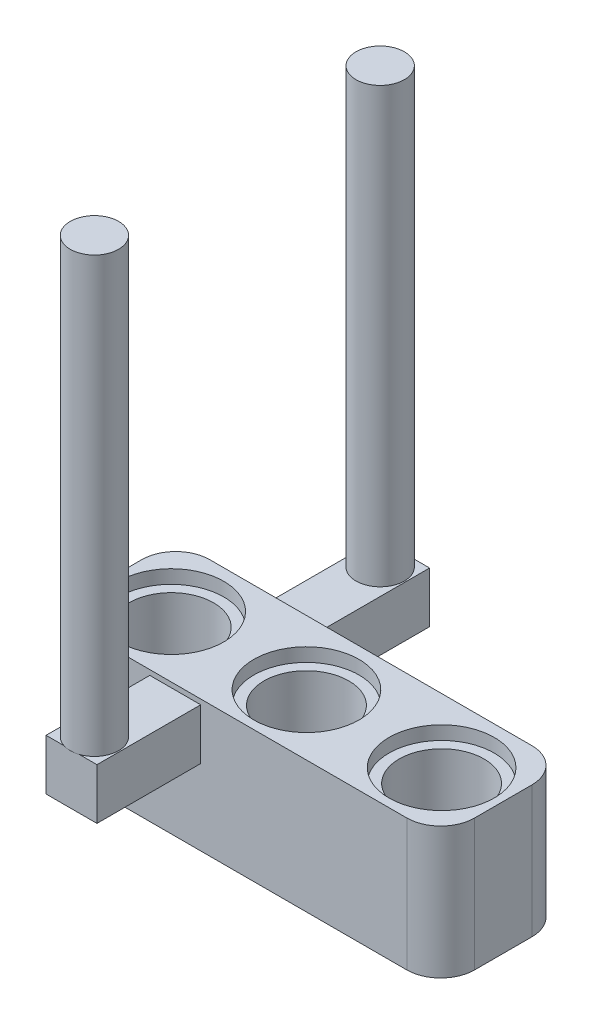
ISO-10303-21;
HEADER;
FILE_DESCRIPTION(('STEP AP214'),'2;1');
FILE_NAME('part.step','',(''),(''),'','','');
FILE_SCHEMA(('AUTOMOTIVE_DESIGN { 1 0 10303 214 1 1 1 1 }'));
ENDSEC;
DATA;
#1=APPLICATION_CONTEXT('core data for automotive mechanical design processes');
#2=APPLICATION_PROTOCOL_DEFINITION('international standard','automotive_design',2000,#1);
#3=PRODUCT_CONTEXT('',#1,'mechanical');
#4=PRODUCT('Part','Part','',(#3));
#5=PRODUCT_RELATED_PRODUCT_CATEGORY('part','',(#4));
#6=PRODUCT_DEFINITION_FORMATION('','',#4);
#7=PRODUCT_DEFINITION_CONTEXT('part definition',#1,'design');
#8=PRODUCT_DEFINITION('design','',#6,#7);
#9=PRODUCT_DEFINITION_SHAPE('','',#8);
#10=(LENGTH_UNIT() NAMED_UNIT(*) SI_UNIT(.MILLI.,.METRE.));
#11=(NAMED_UNIT(*) PLANE_ANGLE_UNIT() SI_UNIT($,.RADIAN.));
#12=(NAMED_UNIT(*) SI_UNIT($,.STERADIAN.) SOLID_ANGLE_UNIT());
#13=UNCERTAINTY_MEASURE_WITH_UNIT(LENGTH_MEASURE(1.E-05),#10,'distance_accuracy_value','');
#14=(GEOMETRIC_REPRESENTATION_CONTEXT(3) GLOBAL_UNCERTAINTY_ASSIGNED_CONTEXT((#13)) GLOBAL_UNIT_ASSIGNED_CONTEXT((#10,
#11,#12)) REPRESENTATION_CONTEXT('',''));
#15=CARTESIAN_POINT('',(0.,0.,0.));
#16=DIRECTION('',(0.,0.,1.));
#17=DIRECTION('',(1.,0.,0.));
#18=AXIS2_PLACEMENT_3D('',#15,#16,#17);
#19=CARTESIAN_POINT('',(0.,7.76,0.));
#20=DIRECTION('',(0.,0.,-1.));
#21=DIRECTION('',(-1.,0.,0.));
#22=AXIS2_PLACEMENT_3D('',#19,#20,#21);
#23=PLANE('',#22);
#24=DIRECTION('',(1.,0.,0.));
#25=VECTOR('',#24,1.);
#26=CARTESIAN_POINT('',(0.,7.76,0.));
#27=LINE('',#26,#25);
#28=CARTESIAN_POINT('',(-21.,7.76,0.));
#29=VERTEX_POINT('',#28);
#30=CARTESIAN_POINT('',(-2.,7.76,0.));
#31=VERTEX_POINT('',#30);
#32=EDGE_CURVE('E310',#29,#31,#27,.T.);
#33=ORIENTED_EDGE('',*,*,#32,.F.);
#34=DIRECTION('',(0.,1.,0.));
#35=VECTOR('',#34,1.);
#36=CARTESIAN_POINT('',(-21.,7.76,0.));
#37=LINE('',#36,#35);
#38=CARTESIAN_POINT('',(-21.,0.,0.));
#39=VERTEX_POINT('',#38);
#40=EDGE_CURVE('E340',#29,#39,#37,.F.);
#41=ORIENTED_EDGE('',*,*,#40,.T.);
#42=DIRECTION('',(1.,0.,0.));
#43=VECTOR('',#42,1.);
#44=CARTESIAN_POINT('',(0.,0.,0.));
#45=LINE('',#44,#43);
#46=CARTESIAN_POINT('',(-2.,0.,0.));
#47=VERTEX_POINT('',#46);
#48=EDGE_CURVE('E306',#39,#47,#45,.T.);
#49=ORIENTED_EDGE('',*,*,#48,.T.);
#50=DIRECTION('',(0.,-1.,0.));
#51=VECTOR('',#50,1.);
#52=CARTESIAN_POINT('',(-2.,7.76,0.));
#53=LINE('',#52,#51);
#54=EDGE_CURVE('E329',#47,#31,#53,.F.);
#55=ORIENTED_EDGE('',*,*,#54,.T.);
#56=EDGE_LOOP('',(#33,#41,#49,#55));
#57=FACE_BOUND('',#56,.T.);
#58=DIRECTION('',(0.,-1.,0.));
#59=VECTOR('',#58,1.);
#60=CARTESIAN_POINT('',(-17.15,7.46280802617594,0.));
#61=LINE('',#60,#59);
#62=CARTESIAN_POINT('',(-17.15,7.46280802617594,0.));
#63=VERTEX_POINT('',#62);
#64=CARTESIAN_POINT('',(-17.15,4.46280802617594,0.));
#65=VERTEX_POINT('',#64);
#66=EDGE_CURVE('E192',#63,#65,#61,.T.);
#67=ORIENTED_EDGE('',*,*,#66,.F.);
#68=DIRECTION('',(-1.,0.,0.));
#69=VECTOR('',#68,1.);
#70=CARTESIAN_POINT('',(-17.15,7.46280802617594,0.));
#71=LINE('',#70,#69);
#72=CARTESIAN_POINT('',(-14.15,7.46280802617594,0.));
#73=VERTEX_POINT('',#72);
#74=EDGE_CURVE('E189',#73,#63,#71,.T.);
#75=ORIENTED_EDGE('',*,*,#74,.F.);
#76=DIRECTION('',(0.,1.,0.));
#77=VECTOR('',#76,1.);
#78=CARTESIAN_POINT('',(-14.15,7.46280802617594,0.));
#79=LINE('',#78,#77);
#80=CARTESIAN_POINT('',(-14.15,4.46280802617594,0.));
#81=VERTEX_POINT('',#80);
#82=EDGE_CURVE('E198',#81,#73,#79,.T.);
#83=ORIENTED_EDGE('',*,*,#82,.F.);
#84=DIRECTION('',(1.,0.,0.));
#85=VECTOR('',#84,1.);
#86=CARTESIAN_POINT('',(-17.15,4.46280802617594,0.));
#87=LINE('',#86,#85);
#88=EDGE_CURVE('E55',#65,#81,#87,.T.);
#89=ORIENTED_EDGE('',*,*,#88,.F.);
#90=EDGE_LOOP('',(#67,#75,#83,#89));
#91=FACE_BOUND('',#90,.T.);
#92=ADVANCED_FACE('F33',(#57,#91),#23,.F.);
#93=CARTESIAN_POINT('',(0.,7.76,-7.38));
#94=DIRECTION('',(0.,0.,1.));
#95=DIRECTION('',(1.,0.,0.));
#96=AXIS2_PLACEMENT_3D('',#93,#94,#95);
#97=PLANE('',#96);
#98=DIRECTION('',(-1.,0.,0.));
#99=VECTOR('',#98,1.);
#100=CARTESIAN_POINT('',(0.,7.76,-7.38));
#101=LINE('',#100,#99);
#102=CARTESIAN_POINT('',(-2.,7.76,-7.38));
#103=VERTEX_POINT('',#102);
#104=CARTESIAN_POINT('',(-21.,7.76,-7.38));
#105=VERTEX_POINT('',#104);
#106=EDGE_CURVE('E305',#103,#105,#101,.T.);
#107=ORIENTED_EDGE('',*,*,#106,.F.);
#108=DIRECTION('',(0.,-1.,0.));
#109=VECTOR('',#108,1.);
#110=CARTESIAN_POINT('',(-2.,7.76,-7.38));
#111=LINE('',#110,#109);
#112=CARTESIAN_POINT('',(-2.,0.,-7.38));
#113=VERTEX_POINT('',#112);
#114=EDGE_CURVE('E359',#103,#113,#111,.T.);
#115=ORIENTED_EDGE('',*,*,#114,.T.);
#116=DIRECTION('',(-1.,0.,0.));
#117=VECTOR('',#116,1.);
#118=CARTESIAN_POINT('',(0.,0.,-7.38));
#119=LINE('',#118,#117);
#120=CARTESIAN_POINT('',(-21.,0.,-7.38));
#121=VERTEX_POINT('',#120);
#122=EDGE_CURVE('E315',#113,#121,#119,.T.);
#123=ORIENTED_EDGE('',*,*,#122,.T.);
#124=DIRECTION('',(0.,1.,0.));
#125=VECTOR('',#124,1.);
#126=CARTESIAN_POINT('',(-21.,7.76,-7.38));
#127=LINE('',#126,#125);
#128=EDGE_CURVE('E348',#121,#105,#127,.T.);
#129=ORIENTED_EDGE('',*,*,#128,.T.);
#130=EDGE_LOOP('',(#107,#115,#123,#129));
#131=FACE_BOUND('',#130,.T.);
#132=DIRECTION('',(0.,-1.,0.));
#133=VECTOR('',#132,1.);
#134=CARTESIAN_POINT('',(-14.15,4.70025145904174,-7.38));
#135=LINE('',#134,#133);
#136=CARTESIAN_POINT('',(-14.15,7.70025145904174,-7.38));
#137=VERTEX_POINT('',#136);
#138=CARTESIAN_POINT('',(-14.15,4.70025145904174,-7.38));
#139=VERTEX_POINT('',#138);
#140=EDGE_CURVE('E215',#137,#139,#135,.T.);
#141=ORIENTED_EDGE('',*,*,#140,.F.);
#142=DIRECTION('',(1.,0.,0.));
#143=VECTOR('',#142,1.);
#144=CARTESIAN_POINT('',(-14.15,7.70025145904174,-7.38));
#145=LINE('',#144,#143);
#146=CARTESIAN_POINT('',(-17.15,7.70025145904174,-7.38));
#147=VERTEX_POINT('',#146);
#148=EDGE_CURVE('E223',#147,#137,#145,.T.);
#149=ORIENTED_EDGE('',*,*,#148,.F.);
#150=DIRECTION('',(0.,1.,0.));
#151=VECTOR('',#150,1.);
#152=CARTESIAN_POINT('',(-17.15,4.70025145904174,-7.38));
#153=LINE('',#152,#151);
#154=CARTESIAN_POINT('',(-17.15,4.70025145904174,-7.38));
#155=VERTEX_POINT('',#154);
#156=EDGE_CURVE('E238',#155,#147,#153,.T.);
#157=ORIENTED_EDGE('',*,*,#156,.F.);
#158=DIRECTION('',(-1.,0.,0.));
#159=VECTOR('',#158,1.);
#160=CARTESIAN_POINT('',(-14.15,4.70025145904174,-7.38));
#161=LINE('',#160,#159);
#162=EDGE_CURVE('E235',#139,#155,#161,.T.);
#163=ORIENTED_EDGE('',*,*,#162,.F.);
#164=EDGE_LOOP('',(#141,#149,#157,#163));
#165=FACE_BOUND('',#164,.T.);
#166=ADVANCED_FACE('F374',(#131,#165),#97,.F.);
#167=CARTESIAN_POINT('',(-2.,7.76,-5.38));
#168=DIRECTION('',(0.,-1.,0.));
#169=DIRECTION('',(0.,0.,-1.));
#170=AXIS2_PLACEMENT_3D('',#167,#168,#169);
#171=CYLINDRICAL_SURFACE('',#170,2.);
#172=ORIENTED_EDGE('',*,*,#114,.F.);
#173=CARTESIAN_POINT('',(-2.,7.76,-5.38));
#174=DIRECTION('',(0.,1.,0.));
#175=DIRECTION('',(0.,0.,1.));
#176=AXIS2_PLACEMENT_3D('',#173,#174,#175);
#177=CIRCLE('',#176,2.);
#178=CARTESIAN_POINT('',(0.,7.76,-5.38));
#179=VERTEX_POINT('',#178);
#180=EDGE_CURVE('E41',#179,#103,#177,.T.);
#181=ORIENTED_EDGE('',*,*,#180,.F.);
#182=DIRECTION('',(0.,-1.,0.));
#183=VECTOR('',#182,1.);
#184=CARTESIAN_POINT('',(0.,7.76,-5.38));
#185=LINE('',#184,#183);
#186=CARTESIAN_POINT('',(0.,0.,-5.38));
#187=VERTEX_POINT('',#186);
#188=EDGE_CURVE('E362',#187,#179,#185,.F.);
#189=ORIENTED_EDGE('',*,*,#188,.F.);
#190=CARTESIAN_POINT('',(-2.,0.,-5.38));
#191=DIRECTION('',(0.,1.,0.));
#192=DIRECTION('',(0.,0.,1.));
#193=AXIS2_PLACEMENT_3D('',#190,#191,#192);
#194=CIRCLE('',#193,2.);
#195=EDGE_CURVE('E11',#113,#187,#194,.F.);
#196=ORIENTED_EDGE('',*,*,#195,.F.);
#197=EDGE_LOOP('',(#172,#181,#189,#196));
#198=FACE_BOUND('',#197,.T.);
#199=ADVANCED_FACE('F35',(#198),#171,.T.);
#200=CARTESIAN_POINT('',(-21.,7.76,-5.38));
#201=DIRECTION('',(0.,1.,0.));
#202=DIRECTION('',(0.,0.,1.));
#203=AXIS2_PLACEMENT_3D('',#200,#201,#202);
#204=CYLINDRICAL_SURFACE('',#203,2.);
#205=ORIENTED_EDGE('',*,*,#128,.F.);
#206=CARTESIAN_POINT('',(-21.,0.,-5.38));
#207=DIRECTION('',(0.,1.,0.));
#208=DIRECTION('',(0.,0.,1.));
#209=AXIS2_PLACEMENT_3D('',#206,#207,#208);
#210=CIRCLE('',#209,2.);
#211=CARTESIAN_POINT('',(-23.,0.,-5.38));
#212=VERTEX_POINT('',#211);
#213=EDGE_CURVE('E354',#212,#121,#210,.F.);
#214=ORIENTED_EDGE('',*,*,#213,.F.);
#215=DIRECTION('',(0.,1.,0.));
#216=VECTOR('',#215,1.);
#217=CARTESIAN_POINT('',(-23.,7.76,-5.38));
#218=LINE('',#217,#216);
#219=CARTESIAN_POINT('',(-23.,7.76,-5.38));
#220=VERTEX_POINT('',#219);
#221=EDGE_CURVE('E351',#220,#212,#218,.F.);
#222=ORIENTED_EDGE('',*,*,#221,.F.);
#223=CARTESIAN_POINT('',(-21.,7.76,-5.38));
#224=DIRECTION('',(0.,1.,0.));
#225=DIRECTION('',(0.,0.,1.));
#226=AXIS2_PLACEMENT_3D('',#223,#224,#225);
#227=CIRCLE('',#226,2.);
#228=EDGE_CURVE('E357',#105,#220,#227,.T.);
#229=ORIENTED_EDGE('',*,*,#228,.F.);
#230=EDGE_LOOP('',(#205,#214,#222,#229));
#231=FACE_BOUND('',#230,.T.);
#232=ADVANCED_FACE('F378',(#231),#204,.T.);
#233=CARTESIAN_POINT('',(-21.,7.76,-2.));
#234=DIRECTION('',(0.,1.,0.));
#235=DIRECTION('',(0.,0.,1.));
#236=AXIS2_PLACEMENT_3D('',#233,#234,#235);
#237=CYLINDRICAL_SURFACE('',#236,2.);
#238=DIRECTION('',(0.,1.,0.));
#239=VECTOR('',#238,1.);
#240=CARTESIAN_POINT('',(-23.,7.76,-2.));
#241=LINE('',#240,#239);
#242=CARTESIAN_POINT('',(-23.,0.,-2.));
#243=VERTEX_POINT('',#242);
#244=CARTESIAN_POINT('',(-23.,7.76,-2.));
#245=VERTEX_POINT('',#244);
#246=EDGE_CURVE('E337',#243,#245,#241,.T.);
#247=ORIENTED_EDGE('',*,*,#246,.F.);
#248=CARTESIAN_POINT('',(-21.,0.,-2.));
#249=DIRECTION('',(0.,1.,0.));
#250=DIRECTION('',(0.,0.,1.));
#251=AXIS2_PLACEMENT_3D('',#248,#249,#250);
#252=CIRCLE('',#251,2.);
#253=EDGE_CURVE('E343',#39,#243,#252,.F.);
#254=ORIENTED_EDGE('',*,*,#253,.F.);
#255=ORIENTED_EDGE('',*,*,#40,.F.);
#256=CARTESIAN_POINT('',(-21.,7.76,-2.));
#257=DIRECTION('',(0.,1.,0.));
#258=DIRECTION('',(0.,0.,1.));
#259=AXIS2_PLACEMENT_3D('',#256,#257,#258);
#260=CIRCLE('',#259,2.);
#261=EDGE_CURVE('E346',#245,#29,#260,.T.);
#262=ORIENTED_EDGE('',*,*,#261,.F.);
#263=EDGE_LOOP('',(#247,#254,#255,#262));
#264=FACE_BOUND('',#263,.T.);
#265=ADVANCED_FACE('F386',(#264),#237,.T.);
#266=CARTESIAN_POINT('',(-2.,7.76,-2.));
#267=DIRECTION('',(0.,-1.,0.));
#268=DIRECTION('',(0.,0.,-1.));
#269=AXIS2_PLACEMENT_3D('',#266,#267,#268);
#270=CYLINDRICAL_SURFACE('',#269,2.);
#271=DIRECTION('',(0.,-1.,0.));
#272=VECTOR('',#271,1.);
#273=CARTESIAN_POINT('',(0.,7.76,-2.));
#274=LINE('',#273,#272);
#275=CARTESIAN_POINT('',(0.,7.76,-2.));
#276=VERTEX_POINT('',#275);
#277=CARTESIAN_POINT('',(0.,0.,-2.));
#278=VERTEX_POINT('',#277);
#279=EDGE_CURVE('E312',#276,#278,#274,.T.);
#280=ORIENTED_EDGE('',*,*,#279,.F.);
#281=CARTESIAN_POINT('',(-2.,7.76,-2.));
#282=DIRECTION('',(0.,1.,0.));
#283=DIRECTION('',(0.,0.,1.));
#284=AXIS2_PLACEMENT_3D('',#281,#282,#283);
#285=CIRCLE('',#284,2.);
#286=EDGE_CURVE('E332',#31,#276,#285,.T.);
#287=ORIENTED_EDGE('',*,*,#286,.F.);
#288=ORIENTED_EDGE('',*,*,#54,.F.);
#289=CARTESIAN_POINT('',(-2.,0.,-2.));
#290=DIRECTION('',(0.,1.,0.));
#291=DIRECTION('',(0.,0.,1.));
#292=AXIS2_PLACEMENT_3D('',#289,#290,#291);
#293=CIRCLE('',#292,2.);
#294=EDGE_CURVE('E334',#278,#47,#293,.F.);
#295=ORIENTED_EDGE('',*,*,#294,.F.);
#296=EDGE_LOOP('',(#280,#287,#288,#295));
#297=FACE_BOUND('',#296,.T.);
#298=ADVANCED_FACE('F398',(#297),#270,.T.);
#299=CARTESIAN_POINT('',(0.,7.76,0.));
#300=DIRECTION('',(-1.,0.,0.));
#301=DIRECTION('',(0.,0.,1.));
#302=AXIS2_PLACEMENT_3D('',#299,#300,#301);
#303=PLANE('',#302);
#304=DIRECTION('',(0.,0.,-1.));
#305=VECTOR('',#304,1.);
#306=CARTESIAN_POINT('',(0.,0.,0.));
#307=LINE('',#306,#305);
#308=EDGE_CURVE('E287',#278,#187,#307,.T.);
#309=ORIENTED_EDGE('',*,*,#308,.T.);
#310=ORIENTED_EDGE('',*,*,#188,.T.);
#311=DIRECTION('',(0.,0.,-1.));
#312=VECTOR('',#311,1.);
#313=CARTESIAN_POINT('',(0.,7.76,0.));
#314=LINE('',#313,#312);
#315=EDGE_CURVE('E302',#276,#179,#314,.T.);
#316=ORIENTED_EDGE('',*,*,#315,.F.);
#317=ORIENTED_EDGE('',*,*,#279,.T.);
#318=EDGE_LOOP('',(#309,#310,#316,#317));
#319=FACE_BOUND('',#318,.T.);
#320=ADVANCED_FACE('F401',(#319),#303,.F.);
#321=CARTESIAN_POINT('',(-23.,7.76,0.));
#322=DIRECTION('',(1.,0.,0.));
#323=DIRECTION('',(0.,0.,-1.));
#324=AXIS2_PLACEMENT_3D('',#321,#322,#323);
#325=PLANE('',#324);
#326=DIRECTION('',(0.,0.,1.));
#327=VECTOR('',#326,1.);
#328=CARTESIAN_POINT('',(-23.,7.76,0.));
#329=LINE('',#328,#327);
#330=EDGE_CURVE('E308',#220,#245,#329,.T.);
#331=ORIENTED_EDGE('',*,*,#330,.F.);
#332=ORIENTED_EDGE('',*,*,#221,.T.);
#333=DIRECTION('',(0.,0.,1.));
#334=VECTOR('',#333,1.);
#335=CARTESIAN_POINT('',(-23.,0.,0.));
#336=LINE('',#335,#334);
#337=EDGE_CURVE('E317',#212,#243,#336,.T.);
#338=ORIENTED_EDGE('',*,*,#337,.T.);
#339=ORIENTED_EDGE('',*,*,#246,.T.);
#340=EDGE_LOOP('',(#331,#332,#338,#339));
#341=FACE_BOUND('',#340,.T.);
#342=ADVANCED_FACE('F388',(#341),#325,.F.);
#343=CARTESIAN_POINT('',(0.,7.76,0.));
#344=DIRECTION('',(0.,1.,0.));
#345=DIRECTION('',(0.,0.,1.));
#346=AXIS2_PLACEMENT_3D('',#343,#344,#345);
#347=PLANE('',#346);
#348=CARTESIAN_POINT('',(-19.4782694052837,7.76,-3.59147010718175));
#349=DIRECTION('',(0.,1.,0.));
#350=DIRECTION('',(0.,0.,1.));
#351=AXIS2_PLACEMENT_3D('',#348,#349,#350);
#352=CIRCLE('',#351,3.1);
#353=CARTESIAN_POINT('',(-19.4782694052837,7.76,-0.49147010718175));
#354=VERTEX_POINT('',#353);
#355=EDGE_CURVE('E268',#354,#354,#352,.T.);
#356=ORIENTED_EDGE('',*,*,#355,.F.);
#357=EDGE_LOOP('',(#356));
#358=FACE_BOUND('',#357,.T.);
#359=CARTESIAN_POINT('',(-11.5082694052837,7.76,-3.59147010718175));
#360=DIRECTION('',(0.,1.,0.));
#361=DIRECTION('',(0.,0.,1.));
#362=AXIS2_PLACEMENT_3D('',#359,#360,#361);
#363=CIRCLE('',#362,3.1);
#364=CARTESIAN_POINT('',(-11.5082694052837,7.76,-0.49147010718175));
#365=VERTEX_POINT('',#364);
#366=EDGE_CURVE('E274',#365,#365,#363,.T.);
#367=ORIENTED_EDGE('',*,*,#366,.F.);
#368=EDGE_LOOP('',(#367));
#369=FACE_BOUND('',#368,.T.);
#370=CARTESIAN_POINT('',(-3.53826940528369,7.76,-3.59147010718175));
#371=DIRECTION('',(0.,1.,0.));
#372=DIRECTION('',(0.,0.,1.));
#373=AXIS2_PLACEMENT_3D('',#370,#371,#372);
#374=CIRCLE('',#373,3.1);
#375=CARTESIAN_POINT('',(-3.53826940528369,7.76,-0.49147010718175));
#376=VERTEX_POINT('',#375);
#377=EDGE_CURVE('E280',#376,#376,#374,.T.);
#378=ORIENTED_EDGE('',*,*,#377,.F.);
#379=EDGE_LOOP('',(#378));
#380=FACE_BOUND('',#379,.T.);
#381=ORIENTED_EDGE('',*,*,#315,.T.);
#382=ORIENTED_EDGE('',*,*,#180,.T.);
#383=ORIENTED_EDGE('',*,*,#106,.T.);
#384=ORIENTED_EDGE('',*,*,#228,.T.);
#385=ORIENTED_EDGE('',*,*,#330,.T.);
#386=ORIENTED_EDGE('',*,*,#261,.T.);
#387=ORIENTED_EDGE('',*,*,#32,.T.);
#388=ORIENTED_EDGE('',*,*,#286,.T.);
#389=EDGE_LOOP('',(#381,#382,#383,#384,#385,#386,#387,#388));
#390=FACE_BOUND('',#389,.T.);
#391=ADVANCED_FACE('F366',(#358,#369,#380,#390),#347,.T.);
#392=CARTESIAN_POINT('',(0.,0.,0.));
#393=DIRECTION('',(0.,1.,0.));
#394=DIRECTION('',(0.,0.,1.));
#395=AXIS2_PLACEMENT_3D('',#392,#393,#394);
#396=PLANE('',#395);
#397=CARTESIAN_POINT('',(-19.5382694052837,0.,-3.69));
#398=DIRECTION('',(0.,-1.,0.));
#399=DIRECTION('',(0.,0.,-1.));
#400=AXIS2_PLACEMENT_3D('',#397,#398,#399);
#401=CIRCLE('',#400,3.1);
#402=CARTESIAN_POINT('',(-19.5382694052837,0.,-6.79));
#403=VERTEX_POINT('',#402);
#404=EDGE_CURVE('E288',#403,#403,#401,.T.);
#405=ORIENTED_EDGE('',*,*,#404,.F.);
#406=EDGE_LOOP('',(#405));
#407=FACE_BOUND('',#406,.T.);
#408=CARTESIAN_POINT('',(-11.5382694052837,0.,-3.68999999999994));
#409=DIRECTION('',(0.,-1.,0.));
#410=DIRECTION('',(0.,0.,-1.));
#411=AXIS2_PLACEMENT_3D('',#408,#409,#410);
#412=CIRCLE('',#411,3.1);
#413=CARTESIAN_POINT('',(-11.5382694052837,0.,-6.78999999999994));
#414=VERTEX_POINT('',#413);
#415=EDGE_CURVE('E294',#414,#414,#412,.T.);
#416=ORIENTED_EDGE('',*,*,#415,.F.);
#417=EDGE_LOOP('',(#416));
#418=FACE_BOUND('',#417,.T.);
#419=CARTESIAN_POINT('',(-3.53826940528369,0.,-3.68999999999989));
#420=DIRECTION('',(0.,-1.,0.));
#421=DIRECTION('',(0.,0.,-1.));
#422=AXIS2_PLACEMENT_3D('',#419,#420,#421);
#423=CIRCLE('',#422,3.1);
#424=CARTESIAN_POINT('',(-3.53826940528369,0.,-6.78999999999988));
#425=VERTEX_POINT('',#424);
#426=EDGE_CURVE('E267',#425,#425,#423,.T.);
#427=ORIENTED_EDGE('',*,*,#426,.F.);
#428=EDGE_LOOP('',(#427));
#429=FACE_BOUND('',#428,.T.);
#430=ORIENTED_EDGE('',*,*,#122,.F.);
#431=ORIENTED_EDGE('',*,*,#195,.T.);
#432=ORIENTED_EDGE('',*,*,#308,.F.);
#433=ORIENTED_EDGE('',*,*,#294,.T.);
#434=ORIENTED_EDGE('',*,*,#48,.F.);
#435=ORIENTED_EDGE('',*,*,#253,.T.);
#436=ORIENTED_EDGE('',*,*,#337,.F.);
#437=ORIENTED_EDGE('',*,*,#213,.T.);
#438=EDGE_LOOP('',(#430,#431,#432,#433,#434,#435,#436,#437));
#439=FACE_BOUND('',#438,.T.);
#440=ADVANCED_FACE('F392',(#407,#418,#429,#439),#396,.F.);
#441=CARTESIAN_POINT('',(-3.53826940528369,0.8,-3.68999999999989));
#442=DIRECTION('',(0.,-1.,0.));
#443=DIRECTION('',(0.,0.,-1.));
#444=AXIS2_PLACEMENT_3D('',#441,#442,#443);
#445=CYLINDRICAL_SURFACE('',#444,3.1);
#446=CARTESIAN_POINT('',(-3.53826940528369,0.8,-3.68999999999989));
#447=DIRECTION('',(0.,-1.,0.));
#448=DIRECTION('',(0.,0.,-1.));
#449=AXIS2_PLACEMENT_3D('',#446,#447,#448);
#450=CIRCLE('',#449,3.1);
#451=CARTESIAN_POINT('',(-3.53826940528369,0.8,-6.78999999999988));
#452=VERTEX_POINT('',#451);
#453=EDGE_CURVE('E297',#452,#452,#450,.T.);
#454=ORIENTED_EDGE('',*,*,#453,.F.);
#455=EDGE_LOOP('',(#454));
#456=FACE_BOUND('',#455,.T.);
#457=ORIENTED_EDGE('',*,*,#426,.T.);
#458=EDGE_LOOP('',(#457));
#459=FACE_BOUND('',#458,.T.);
#460=ADVANCED_FACE('F419',(#456,#459),#445,.F.);
#461=CARTESIAN_POINT('',(-3.53826940528369,0.8,-3.68999999999989));
#462=DIRECTION('',(0.,-1.,0.));
#463=DIRECTION('',(0.,0.,-1.));
#464=AXIS2_PLACEMENT_3D('',#461,#462,#463);
#465=PLANE('',#464);
#466=CARTESIAN_POINT('',(-3.53826940528369,0.8,-3.59147010718175));
#467=DIRECTION('',(0.,-1.,0.));
#468=DIRECTION('',(0.,0.,-1.));
#469=AXIS2_PLACEMENT_3D('',#466,#467,#468);
#470=CIRCLE('',#469,2.5);
#471=CARTESIAN_POINT('',(-3.53826940528369,0.8,-6.09147010718175));
#472=VERTEX_POINT('',#471);
#473=EDGE_CURVE('E255',#472,#472,#470,.T.);
#474=ORIENTED_EDGE('',*,*,#473,.F.);
#475=EDGE_LOOP('',(#474));
#476=FACE_BOUND('',#475,.T.);
#477=ORIENTED_EDGE('',*,*,#453,.T.);
#478=EDGE_LOOP('',(#477));
#479=FACE_BOUND('',#478,.T.);
#480=ADVANCED_FACE('F426',(#476,#479),#465,.T.);
#481=CARTESIAN_POINT('',(-11.5382694052837,0.8,-3.68999999999994));
#482=DIRECTION('',(0.,-1.,0.));
#483=DIRECTION('',(0.,0.,-1.));
#484=AXIS2_PLACEMENT_3D('',#481,#482,#483);
#485=CYLINDRICAL_SURFACE('',#484,3.1);
#486=CARTESIAN_POINT('',(-11.5382694052837,0.8,-3.68999999999994));
#487=DIRECTION('',(0.,-1.,0.));
#488=DIRECTION('',(0.,0.,-1.));
#489=AXIS2_PLACEMENT_3D('',#486,#487,#488);
#490=CIRCLE('',#489,3.1);
#491=CARTESIAN_POINT('',(-11.5382694052837,0.8,-6.78999999999994));
#492=VERTEX_POINT('',#491);
#493=EDGE_CURVE('E291',#492,#492,#490,.T.);
#494=ORIENTED_EDGE('',*,*,#493,.F.);
#495=EDGE_LOOP('',(#494));
#496=FACE_BOUND('',#495,.T.);
#497=ORIENTED_EDGE('',*,*,#415,.T.);
#498=EDGE_LOOP('',(#497));
#499=FACE_BOUND('',#498,.T.);
#500=ADVANCED_FACE('F430',(#496,#499),#485,.F.);
#501=CARTESIAN_POINT('',(-11.5382694052837,0.8,-3.68999999999994));
#502=DIRECTION('',(0.,-1.,0.));
#503=DIRECTION('',(0.,0.,-1.));
#504=AXIS2_PLACEMENT_3D('',#501,#502,#503);
#505=PLANE('',#504);
#506=CARTESIAN_POINT('',(-11.5082694052837,0.8,-3.59147010718175));
#507=DIRECTION('',(0.,-1.,0.));
#508=DIRECTION('',(0.,0.,-1.));
#509=AXIS2_PLACEMENT_3D('',#506,#507,#508);
#510=CIRCLE('',#509,2.5);
#511=CARTESIAN_POINT('',(-11.5082694052837,0.8,-6.09147010718175));
#512=VERTEX_POINT('',#511);
#513=EDGE_CURVE('E259',#512,#512,#510,.T.);
#514=ORIENTED_EDGE('',*,*,#513,.F.);
#515=EDGE_LOOP('',(#514));
#516=FACE_BOUND('',#515,.T.);
#517=ORIENTED_EDGE('',*,*,#493,.T.);
#518=EDGE_LOOP('',(#517));
#519=FACE_BOUND('',#518,.T.);
#520=ADVANCED_FACE('F434',(#516,#519),#505,.T.);
#521=CARTESIAN_POINT('',(-19.5382694052837,0.8,-3.69));
#522=DIRECTION('',(0.,-1.,0.));
#523=DIRECTION('',(0.,0.,-1.));
#524=AXIS2_PLACEMENT_3D('',#521,#522,#523);
#525=CYLINDRICAL_SURFACE('',#524,3.1);
#526=CARTESIAN_POINT('',(-19.5382694052837,0.8,-3.69));
#527=DIRECTION('',(0.,-1.,0.));
#528=DIRECTION('',(0.,0.,-1.));
#529=AXIS2_PLACEMENT_3D('',#526,#527,#528);
#530=CIRCLE('',#529,3.1);
#531=CARTESIAN_POINT('',(-19.5382694052837,0.8,-6.79));
#532=VERTEX_POINT('',#531);
#533=EDGE_CURVE('E284',#532,#532,#530,.T.);
#534=ORIENTED_EDGE('',*,*,#533,.F.);
#535=EDGE_LOOP('',(#534));
#536=FACE_BOUND('',#535,.T.);
#537=ORIENTED_EDGE('',*,*,#404,.T.);
#538=EDGE_LOOP('',(#537));
#539=FACE_BOUND('',#538,.T.);
#540=ADVANCED_FACE('F438',(#536,#539),#525,.F.);
#541=CARTESIAN_POINT('',(-19.5382694052837,0.8,-3.69));
#542=DIRECTION('',(0.,-1.,0.));
#543=DIRECTION('',(0.,0.,-1.));
#544=AXIS2_PLACEMENT_3D('',#541,#542,#543);
#545=PLANE('',#544);
#546=CARTESIAN_POINT('',(-19.4782694052837,0.8,-3.59147010718175));
#547=DIRECTION('',(0.,-1.,0.));
#548=DIRECTION('',(0.,0.,-1.));
#549=AXIS2_PLACEMENT_3D('',#546,#547,#548);
#550=CIRCLE('',#549,2.5);
#551=CARTESIAN_POINT('',(-19.4782694052837,0.8,-6.09147010718175));
#552=VERTEX_POINT('',#551);
#553=EDGE_CURVE('E254',#552,#552,#550,.T.);
#554=ORIENTED_EDGE('',*,*,#553,.F.);
#555=EDGE_LOOP('',(#554));
#556=FACE_BOUND('',#555,.T.);
#557=ORIENTED_EDGE('',*,*,#533,.T.);
#558=EDGE_LOOP('',(#557));
#559=FACE_BOUND('',#558,.T.);
#560=ADVANCED_FACE('F442',(#556,#559),#545,.T.);
#561=CARTESIAN_POINT('',(-3.53826940528369,6.96,-3.59147010718175));
#562=DIRECTION('',(0.,1.,0.));
#563=DIRECTION('',(0.,0.,1.));
#564=AXIS2_PLACEMENT_3D('',#561,#562,#563);
#565=CYLINDRICAL_SURFACE('',#564,3.1);
#566=CARTESIAN_POINT('',(-3.53826940528369,6.96,-3.59147010718175));
#567=DIRECTION('',(0.,1.,0.));
#568=DIRECTION('',(0.,0.,1.));
#569=AXIS2_PLACEMENT_3D('',#566,#567,#568);
#570=CIRCLE('',#569,3.1);
#571=CARTESIAN_POINT('',(-3.53826940528369,6.96,-0.49147010718175));
#572=VERTEX_POINT('',#571);
#573=EDGE_CURVE('E277',#572,#572,#570,.T.);
#574=ORIENTED_EDGE('',*,*,#573,.F.);
#575=EDGE_LOOP('',(#574));
#576=FACE_BOUND('',#575,.T.);
#577=ORIENTED_EDGE('',*,*,#377,.T.);
#578=EDGE_LOOP('',(#577));
#579=FACE_BOUND('',#578,.T.);
#580=ADVANCED_FACE('F446',(#576,#579),#565,.F.);
#581=CARTESIAN_POINT('',(-3.53826940528369,6.96,-3.59147010718175));
#582=DIRECTION('',(0.,1.,0.));
#583=DIRECTION('',(0.,0.,1.));
#584=AXIS2_PLACEMENT_3D('',#581,#582,#583);
#585=PLANE('',#584);
#586=CARTESIAN_POINT('',(-3.53826940528369,6.96,-3.59147010718175));
#587=DIRECTION('',(0.,1.,0.));
#588=DIRECTION('',(0.,0.,1.));
#589=AXIS2_PLACEMENT_3D('',#586,#587,#588);
#590=CIRCLE('',#589,2.5);
#591=CARTESIAN_POINT('',(-3.53826940528369,6.96,-1.09147010718175));
#592=VERTEX_POINT('',#591);
#593=EDGE_CURVE('E283',#592,#592,#590,.T.);
#594=ORIENTED_EDGE('',*,*,#593,.F.);
#595=EDGE_LOOP('',(#594));
#596=FACE_BOUND('',#595,.T.);
#597=ORIENTED_EDGE('',*,*,#573,.T.);
#598=EDGE_LOOP('',(#597));
#599=FACE_BOUND('',#598,.T.);
#600=ADVANCED_FACE('F450',(#596,#599),#585,.T.);
#601=CARTESIAN_POINT('',(-11.5082694052837,6.96,-3.59147010718175));
#602=DIRECTION('',(0.,1.,0.));
#603=DIRECTION('',(0.,0.,1.));
#604=AXIS2_PLACEMENT_3D('',#601,#602,#603);
#605=CYLINDRICAL_SURFACE('',#604,3.1);
#606=CARTESIAN_POINT('',(-11.5082694052837,6.96,-3.59147010718175));
#607=DIRECTION('',(0.,1.,0.));
#608=DIRECTION('',(0.,0.,1.));
#609=AXIS2_PLACEMENT_3D('',#606,#607,#608);
#610=CIRCLE('',#609,3.1);
#611=CARTESIAN_POINT('',(-11.5082694052837,6.96,-0.49147010718175));
#612=VERTEX_POINT('',#611);
#613=EDGE_CURVE('E271',#612,#612,#610,.T.);
#614=ORIENTED_EDGE('',*,*,#613,.F.);
#615=EDGE_LOOP('',(#614));
#616=FACE_BOUND('',#615,.T.);
#617=ORIENTED_EDGE('',*,*,#366,.T.);
#618=EDGE_LOOP('',(#617));
#619=FACE_BOUND('',#618,.T.);
#620=ADVANCED_FACE('F454',(#616,#619),#605,.F.);
#621=CARTESIAN_POINT('',(-11.5082694052837,6.96,-3.59147010718175));
#622=DIRECTION('',(0.,1.,0.));
#623=DIRECTION('',(0.,0.,1.));
#624=AXIS2_PLACEMENT_3D('',#621,#622,#623);
#625=PLANE('',#624);
#626=CARTESIAN_POINT('',(-11.5082694052837,6.96,-3.59147010718175));
#627=DIRECTION('',(0.,1.,0.));
#628=DIRECTION('',(0.,0.,1.));
#629=AXIS2_PLACEMENT_3D('',#626,#627,#628);
#630=CIRCLE('',#629,2.5);
#631=CARTESIAN_POINT('',(-11.5082694052837,6.96,-1.09147010718175));
#632=VERTEX_POINT('',#631);
#633=EDGE_CURVE('E322',#632,#632,#630,.T.);
#634=ORIENTED_EDGE('',*,*,#633,.F.);
#635=EDGE_LOOP('',(#634));
#636=FACE_BOUND('',#635,.T.);
#637=ORIENTED_EDGE('',*,*,#613,.T.);
#638=EDGE_LOOP('',(#637));
#639=FACE_BOUND('',#638,.T.);
#640=ADVANCED_FACE('F458',(#636,#639),#625,.T.);
#641=CARTESIAN_POINT('',(-19.4782694052837,6.96,-3.59147010718175));
#642=DIRECTION('',(0.,1.,0.));
#643=DIRECTION('',(0.,0.,1.));
#644=AXIS2_PLACEMENT_3D('',#641,#642,#643);
#645=CYLINDRICAL_SURFACE('',#644,3.1);
#646=CARTESIAN_POINT('',(-19.4782694052837,6.96,-3.59147010718175));
#647=DIRECTION('',(0.,1.,0.));
#648=DIRECTION('',(0.,0.,1.));
#649=AXIS2_PLACEMENT_3D('',#646,#647,#648);
#650=CIRCLE('',#649,3.1);
#651=CARTESIAN_POINT('',(-19.4782694052837,6.96,-0.49147010718175));
#652=VERTEX_POINT('',#651);
#653=EDGE_CURVE('E264',#652,#652,#650,.T.);
#654=ORIENTED_EDGE('',*,*,#653,.F.);
#655=EDGE_LOOP('',(#654));
#656=FACE_BOUND('',#655,.T.);
#657=ORIENTED_EDGE('',*,*,#355,.T.);
#658=EDGE_LOOP('',(#657));
#659=FACE_BOUND('',#658,.T.);
#660=ADVANCED_FACE('F462',(#656,#659),#645,.F.);
#661=CARTESIAN_POINT('',(-19.4782694052837,6.96,-3.59147010718175));
#662=DIRECTION('',(0.,1.,0.));
#663=DIRECTION('',(0.,0.,1.));
#664=AXIS2_PLACEMENT_3D('',#661,#662,#663);
#665=PLANE('',#664);
#666=CARTESIAN_POINT('',(-19.4782694052837,6.96,-3.59147010718175));
#667=DIRECTION('',(0.,1.,0.));
#668=DIRECTION('',(0.,0.,1.));
#669=AXIS2_PLACEMENT_3D('',#666,#667,#668);
#670=CIRCLE('',#669,2.5);
#671=CARTESIAN_POINT('',(-19.4782694052837,6.96,-1.09147010718175));
#672=VERTEX_POINT('',#671);
#673=EDGE_CURVE('E258',#672,#672,#670,.T.);
#674=ORIENTED_EDGE('',*,*,#673,.F.);
#675=EDGE_LOOP('',(#674));
#676=FACE_BOUND('',#675,.T.);
#677=ORIENTED_EDGE('',*,*,#653,.T.);
#678=EDGE_LOOP('',(#677));
#679=FACE_BOUND('',#678,.T.);
#680=ADVANCED_FACE('F466',(#676,#679),#665,.T.);
#681=CARTESIAN_POINT('',(-19.4782694052837,7.76,-3.59147010718175));
#682=DIRECTION('',(0.,-1.,0.));
#683=DIRECTION('',(0.,0.,-1.));
#684=AXIS2_PLACEMENT_3D('',#681,#682,#683);
#685=CYLINDRICAL_SURFACE('',#684,2.5);
#686=ORIENTED_EDGE('',*,*,#673,.T.);
#687=EDGE_LOOP('',(#686));
#688=FACE_BOUND('',#687,.T.);
#689=ORIENTED_EDGE('',*,*,#553,.T.);
#690=EDGE_LOOP('',(#689));
#691=FACE_BOUND('',#690,.T.);
#692=ADVANCED_FACE('F470',(#688,#691),#685,.F.);
#693=CARTESIAN_POINT('',(-11.5082694052837,7.76,-3.59147010718175));
#694=DIRECTION('',(0.,-1.,0.));
#695=DIRECTION('',(0.,0.,-1.));
#696=AXIS2_PLACEMENT_3D('',#693,#694,#695);
#697=CYLINDRICAL_SURFACE('',#696,2.5);
#698=ORIENTED_EDGE('',*,*,#633,.T.);
#699=EDGE_LOOP('',(#698));
#700=FACE_BOUND('',#699,.T.);
#701=ORIENTED_EDGE('',*,*,#513,.T.);
#702=EDGE_LOOP('',(#701));
#703=FACE_BOUND('',#702,.T.);
#704=ADVANCED_FACE('F474',(#700,#703),#697,.F.);
#705=CARTESIAN_POINT('',(-3.53826940528369,7.76,-3.59147010718175));
#706=DIRECTION('',(0.,-1.,0.));
#707=DIRECTION('',(0.,0.,-1.));
#708=AXIS2_PLACEMENT_3D('',#705,#706,#707);
#709=CYLINDRICAL_SURFACE('',#708,2.5);
#710=ORIENTED_EDGE('',*,*,#593,.T.);
#711=EDGE_LOOP('',(#710));
#712=FACE_BOUND('',#711,.T.);
#713=ORIENTED_EDGE('',*,*,#473,.T.);
#714=EDGE_LOOP('',(#713));
#715=FACE_BOUND('',#714,.T.);
#716=ADVANCED_FACE('F478',(#712,#715),#709,.F.);
#717=CARTESIAN_POINT('',(-14.15,4.70025145904174,-13.495));
#718=DIRECTION('',(-1.,0.,0.));
#719=DIRECTION('',(0.,0.,1.));
#720=AXIS2_PLACEMENT_3D('',#717,#718,#719);
#721=PLANE('',#720);
#722=ORIENTED_EDGE('',*,*,#140,.T.);
#723=DIRECTION('',(0.,0.,1.));
#724=VECTOR('',#723,1.);
#725=CARTESIAN_POINT('',(-14.15,4.70025145904174,-13.495));
#726=LINE('',#725,#724);
#727=CARTESIAN_POINT('',(-14.15,4.70025145904174,-13.495));
#728=VERTEX_POINT('',#727);
#729=EDGE_CURVE('E251',#728,#139,#726,.T.);
#730=ORIENTED_EDGE('',*,*,#729,.F.);
#731=DIRECTION('',(0.,-1.,0.));
#732=VECTOR('',#731,1.);
#733=CARTESIAN_POINT('',(-14.15,4.70025145904174,-13.495));
#734=LINE('',#733,#732);
#735=CARTESIAN_POINT('',(-14.15,7.70025145904174,-13.495));
#736=VERTEX_POINT('',#735);
#737=EDGE_CURVE('E219',#736,#728,#734,.T.);
#738=ORIENTED_EDGE('',*,*,#737,.F.);
#739=DIRECTION('',(0.,0.,1.));
#740=VECTOR('',#739,1.);
#741=CARTESIAN_POINT('',(-14.15,7.70025145904174,-13.495));
#742=LINE('',#741,#740);
#743=EDGE_CURVE('E231',#736,#137,#742,.T.);
#744=ORIENTED_EDGE('',*,*,#743,.T.);
#745=EDGE_LOOP('',(#722,#730,#738,#744));
#746=FACE_BOUND('',#745,.T.);
#747=ADVANCED_FACE('F482',(#746),#721,.F.);
#748=CARTESIAN_POINT('',(-14.15,4.70025145904174,-13.495));
#749=DIRECTION('',(0.,1.,0.));
#750=DIRECTION('',(0.,0.,1.));
#751=AXIS2_PLACEMENT_3D('',#748,#749,#750);
#752=PLANE('',#751);
#753=ORIENTED_EDGE('',*,*,#162,.T.);
#754=DIRECTION('',(0.,0.,1.));
#755=VECTOR('',#754,1.);
#756=CARTESIAN_POINT('',(-17.15,4.70025145904174,-13.495));
#757=LINE('',#756,#755);
#758=CARTESIAN_POINT('',(-17.15,4.70025145904174,-13.495));
#759=VERTEX_POINT('',#758);
#760=EDGE_CURVE('E248',#759,#155,#757,.T.);
#761=ORIENTED_EDGE('',*,*,#760,.F.);
#762=DIRECTION('',(-1.,0.,0.));
#763=VECTOR('',#762,1.);
#764=CARTESIAN_POINT('',(-14.15,4.70025145904174,-13.495));
#765=LINE('',#764,#763);
#766=EDGE_CURVE('E222',#728,#759,#765,.T.);
#767=ORIENTED_EDGE('',*,*,#766,.F.);
#768=ORIENTED_EDGE('',*,*,#729,.T.);
#769=EDGE_LOOP('',(#753,#761,#767,#768));
#770=FACE_BOUND('',#769,.T.);
#771=ADVANCED_FACE('F486',(#770),#752,.F.);
#772=CARTESIAN_POINT('',(-17.15,4.70025145904174,-13.495));
#773=DIRECTION('',(1.,0.,0.));
#774=DIRECTION('',(0.,0.,-1.));
#775=AXIS2_PLACEMENT_3D('',#772,#773,#774);
#776=PLANE('',#775);
#777=ORIENTED_EDGE('',*,*,#156,.T.);
#778=DIRECTION('',(0.,0.,1.));
#779=VECTOR('',#778,1.);
#780=CARTESIAN_POINT('',(-17.15,7.70025145904174,-13.495));
#781=LINE('',#780,#779);
#782=CARTESIAN_POINT('',(-17.15,7.70025145904174,-13.495));
#783=VERTEX_POINT('',#782);
#784=EDGE_CURVE('E245',#783,#147,#781,.T.);
#785=ORIENTED_EDGE('',*,*,#784,.F.);
#786=DIRECTION('',(0.,1.,0.));
#787=VECTOR('',#786,1.);
#788=CARTESIAN_POINT('',(-17.15,4.70025145904174,-13.495));
#789=LINE('',#788,#787);
#790=EDGE_CURVE('E225',#759,#783,#789,.T.);
#791=ORIENTED_EDGE('',*,*,#790,.F.);
#792=ORIENTED_EDGE('',*,*,#760,.T.);
#793=EDGE_LOOP('',(#777,#785,#791,#792));
#794=FACE_BOUND('',#793,.T.);
#795=ADVANCED_FACE('F490',(#794),#776,.F.);
#796=CARTESIAN_POINT('',(-14.15,7.70025145904174,-13.495));
#797=DIRECTION('',(0.,-1.,0.));
#798=DIRECTION('',(0.,0.,-1.));
#799=AXIS2_PLACEMENT_3D('',#796,#797,#798);
#800=PLANE('',#799);
#801=CARTESIAN_POINT('',(-15.65,7.70025145904174,-12.0819630914042));
#802=DIRECTION('',(0.,1.,0.));
#803=DIRECTION('',(0.,0.,1.));
#804=AXIS2_PLACEMENT_3D('',#801,#802,#803);
#805=CIRCLE('',#804,1.425);
#806=CARTESIAN_POINT('',(-15.8342598571203,7.70025145904174,-13.495));
#807=VERTEX_POINT('',#806);
#808=CARTESIAN_POINT('',(-15.4657401428797,7.70025145904174,-13.495));
#809=VERTEX_POINT('',#808);
#810=EDGE_CURVE('E211',#807,#809,#805,.T.);
#811=ORIENTED_EDGE('',*,*,#810,.F.);
#812=DIRECTION('',(1.,0.,0.));
#813=VECTOR('',#812,1.);
#814=CARTESIAN_POINT('',(-14.15,7.70025145904174,-13.495));
#815=LINE('',#814,#813);
#816=EDGE_CURVE('E228',#783,#807,#815,.T.);
#817=ORIENTED_EDGE('',*,*,#816,.F.);
#818=ORIENTED_EDGE('',*,*,#784,.T.);
#819=ORIENTED_EDGE('',*,*,#148,.T.);
#820=ORIENTED_EDGE('',*,*,#743,.F.);
#821=EDGE_CURVE('E227',#809,#736,#815,.T.);
#822=ORIENTED_EDGE('',*,*,#821,.F.);
#823=EDGE_LOOP('',(#811,#817,#818,#819,#820,#822));
#824=FACE_BOUND('',#823,.T.);
#825=ADVANCED_FACE('F494',(#824),#800,.F.);
#826=CARTESIAN_POINT('',(0.,0.,-13.495));
#827=DIRECTION('',(0.,0.,1.));
#828=DIRECTION('',(1.,0.,0.));
#829=AXIS2_PLACEMENT_3D('',#826,#827,#828);
#830=PLANE('',#829);
#831=ORIENTED_EDGE('',*,*,#737,.T.);
#832=ORIENTED_EDGE('',*,*,#766,.T.);
#833=ORIENTED_EDGE('',*,*,#790,.T.);
#834=ORIENTED_EDGE('',*,*,#816,.T.);
#835=EDGE_CURVE('E232',#807,#809,#815,.T.);
#836=ORIENTED_EDGE('',*,*,#835,.T.);
#837=ORIENTED_EDGE('',*,*,#821,.T.);
#838=EDGE_LOOP('',(#831,#832,#833,#834,#836,#837));
#839=FACE_BOUND('',#838,.T.);
#840=ADVANCED_FACE('F498',(#839),#830,.F.);
#841=CARTESIAN_POINT('',(-15.65,7.70025145904174,-12.0819630914042));
#842=DIRECTION('',(0.,1.,0.));
#843=DIRECTION('',(0.,0.,1.));
#844=AXIS2_PLACEMENT_3D('',#841,#842,#843);
#845=PLANE('',#844);
#846=EDGE_CURVE('E216',#809,#807,#805,.T.);
#847=ORIENTED_EDGE('',*,*,#846,.F.);
#848=ORIENTED_EDGE('',*,*,#835,.F.);
#849=EDGE_LOOP('',(#847,#848));
#850=FACE_BOUND('',#849,.T.);
#851=ADVANCED_FACE('F502',(#850),#845,.F.);
#852=CARTESIAN_POINT('',(-15.65,33.3002514590417,-12.0819630914042));
#853=DIRECTION('',(0.,-1.,0.));
#854=DIRECTION('',(0.,0.,-1.));
#855=AXIS2_PLACEMENT_3D('',#852,#853,#854);
#856=CYLINDRICAL_SURFACE('',#855,1.425);
#857=CARTESIAN_POINT('',(-15.65,33.3002514590417,-12.0819630914042));
#858=DIRECTION('',(0.,1.,0.));
#859=DIRECTION('',(0.,0.,1.));
#860=AXIS2_PLACEMENT_3D('',#857,#858,#859);
#861=CIRCLE('',#860,1.425);
#862=CARTESIAN_POINT('',(-15.65,33.3002514590417,-10.6569630914042));
#863=VERTEX_POINT('',#862);
#864=EDGE_CURVE('E212',#863,#863,#861,.T.);
#865=ORIENTED_EDGE('',*,*,#864,.F.);
#866=EDGE_LOOP('',(#865));
#867=FACE_BOUND('',#866,.T.);
#868=ORIENTED_EDGE('',*,*,#846,.T.);
#869=ORIENTED_EDGE('',*,*,#810,.T.);
#870=EDGE_LOOP('',(#868,#869));
#871=FACE_BOUND('',#870,.T.);
#872=ADVANCED_FACE('F504',(#867,#871),#856,.T.);
#873=CARTESIAN_POINT('',(-15.65,33.3002514590417,-12.0819630914042));
#874=DIRECTION('',(0.,1.,0.));
#875=DIRECTION('',(0.,0.,1.));
#876=AXIS2_PLACEMENT_3D('',#873,#874,#875);
#877=PLANE('',#876);
#878=ORIENTED_EDGE('',*,*,#864,.T.);
#879=EDGE_LOOP('',(#878));
#880=FACE_BOUND('',#879,.T.);
#881=ADVANCED_FACE('F507',(#880),#877,.T.);
#882=CARTESIAN_POINT('',(-17.15,7.46280802617594,6.115));
#883=DIRECTION('',(1.,0.,0.));
#884=DIRECTION('',(0.,0.,-1.));
#885=AXIS2_PLACEMENT_3D('',#882,#883,#884);
#886=PLANE('',#885);
#887=ORIENTED_EDGE('',*,*,#66,.T.);
#888=DIRECTION('',(0.,0.,-1.));
#889=VECTOR('',#888,1.);
#890=CARTESIAN_POINT('',(-17.15,4.46280802617594,6.115));
#891=LINE('',#890,#889);
#892=CARTESIAN_POINT('',(-17.15,4.46280802617594,6.115));
#893=VERTEX_POINT('',#892);
#894=EDGE_CURVE('E209',#893,#65,#891,.T.);
#895=ORIENTED_EDGE('',*,*,#894,.F.);
#896=DIRECTION('',(0.,-1.,0.));
#897=VECTOR('',#896,1.);
#898=CARTESIAN_POINT('',(-17.15,7.46280802617594,6.115));
#899=LINE('',#898,#897);
#900=CARTESIAN_POINT('',(-17.15,7.46280802617594,6.115));
#901=VERTEX_POINT('',#900);
#902=EDGE_CURVE('E186',#901,#893,#899,.T.);
#903=ORIENTED_EDGE('',*,*,#902,.F.);
#904=DIRECTION('',(0.,0.,-1.));
#905=VECTOR('',#904,1.);
#906=CARTESIAN_POINT('',(-17.15,7.46280802617594,6.115));
#907=LINE('',#906,#905);
#908=EDGE_CURVE('E179',#901,#63,#907,.T.);
#909=ORIENTED_EDGE('',*,*,#908,.T.);
#910=EDGE_LOOP('',(#887,#895,#903,#909));
#911=FACE_BOUND('',#910,.T.);
#912=ADVANCED_FACE('F514',(#911),#886,.F.);
#913=CARTESIAN_POINT('',(-17.15,4.46280802617594,6.115));
#914=DIRECTION('',(0.,1.,0.));
#915=DIRECTION('',(0.,0.,1.));
#916=AXIS2_PLACEMENT_3D('',#913,#914,#915);
#917=PLANE('',#916);
#918=ORIENTED_EDGE('',*,*,#88,.T.);
#919=DIRECTION('',(0.,0.,-1.));
#920=VECTOR('',#919,1.);
#921=CARTESIAN_POINT('',(-14.15,4.46280802617594,6.115));
#922=LINE('',#921,#920);
#923=CARTESIAN_POINT('',(-14.15,4.46280802617594,6.115));
#924=VERTEX_POINT('',#923);
#925=EDGE_CURVE('E206',#924,#81,#922,.T.);
#926=ORIENTED_EDGE('',*,*,#925,.F.);
#927=DIRECTION('',(1.,0.,0.));
#928=VECTOR('',#927,1.);
#929=CARTESIAN_POINT('',(-17.15,4.46280802617594,6.115));
#930=LINE('',#929,#928);
#931=EDGE_CURVE('E185',#893,#924,#930,.T.);
#932=ORIENTED_EDGE('',*,*,#931,.F.);
#933=ORIENTED_EDGE('',*,*,#894,.T.);
#934=EDGE_LOOP('',(#918,#926,#932,#933));
#935=FACE_BOUND('',#934,.T.);
#936=ADVANCED_FACE('F518',(#935),#917,.F.);
#937=CARTESIAN_POINT('',(-14.15,7.46280802617594,6.115));
#938=DIRECTION('',(-1.,0.,0.));
#939=DIRECTION('',(0.,0.,1.));
#940=AXIS2_PLACEMENT_3D('',#937,#938,#939);
#941=PLANE('',#940);
#942=ORIENTED_EDGE('',*,*,#82,.T.);
#943=DIRECTION('',(0.,0.,-1.));
#944=VECTOR('',#943,1.);
#945=CARTESIAN_POINT('',(-14.15,7.46280802617594,6.115));
#946=LINE('',#945,#944);
#947=CARTESIAN_POINT('',(-14.15,7.46280802617594,6.115));
#948=VERTEX_POINT('',#947);
#949=EDGE_CURVE('E181',#948,#73,#946,.T.);
#950=ORIENTED_EDGE('',*,*,#949,.F.);
#951=DIRECTION('',(0.,1.,0.));
#952=VECTOR('',#951,1.);
#953=CARTESIAN_POINT('',(-14.15,7.46280802617594,6.115));
#954=LINE('',#953,#952);
#955=EDGE_CURVE('E177',#924,#948,#954,.T.);
#956=ORIENTED_EDGE('',*,*,#955,.F.);
#957=ORIENTED_EDGE('',*,*,#925,.T.);
#958=EDGE_LOOP('',(#942,#950,#956,#957));
#959=FACE_BOUND('',#958,.T.);
#960=ADVANCED_FACE('F521',(#959),#941,.F.);
#961=CARTESIAN_POINT('',(-17.15,7.46280802617594,6.115));
#962=DIRECTION('',(0.,-1.,0.));
#963=DIRECTION('',(0.,0.,-1.));
#964=AXIS2_PLACEMENT_3D('',#961,#962,#963);
#965=PLANE('',#964);
#966=CARTESIAN_POINT('',(-15.65,7.46280802617594,4.76328426804429));
#967=DIRECTION('',(0.,1.,0.));
#968=DIRECTION('',(0.,0.,1.));
#969=AXIS2_PLACEMENT_3D('',#966,#967,#968);
#970=CIRCLE('',#969,1.425);
#971=CARTESIAN_POINT('',(-15.1989018067167,7.46280802617594,6.115));
#972=VERTEX_POINT('',#971);
#973=CARTESIAN_POINT('',(-16.1010981932833,7.46280802617594,6.115));
#974=VERTEX_POINT('',#973);
#975=EDGE_CURVE('E47',#972,#974,#970,.T.);
#976=ORIENTED_EDGE('',*,*,#975,.F.);
#977=DIRECTION('',(-1.,0.,0.));
#978=VECTOR('',#977,1.);
#979=CARTESIAN_POINT('',(-17.15,7.46280802617594,6.115));
#980=LINE('',#979,#978);
#981=EDGE_CURVE('E163',#948,#972,#980,.T.);
#982=ORIENTED_EDGE('',*,*,#981,.F.);
#983=ORIENTED_EDGE('',*,*,#949,.T.);
#984=ORIENTED_EDGE('',*,*,#74,.T.);
#985=ORIENTED_EDGE('',*,*,#908,.F.);
#986=EDGE_CURVE('E164',#974,#901,#980,.T.);
#987=ORIENTED_EDGE('',*,*,#986,.F.);
#988=EDGE_LOOP('',(#976,#982,#983,#984,#985,#987));
#989=FACE_BOUND('',#988,.T.);
#990=ADVANCED_FACE('F170',(#989),#965,.F.);
#991=CARTESIAN_POINT('',(0.,0.,6.115));
#992=DIRECTION('',(0.,0.,1.));
#993=DIRECTION('',(1.,0.,0.));
#994=AXIS2_PLACEMENT_3D('',#991,#992,#993);
#995=PLANE('',#994);
#996=ORIENTED_EDGE('',*,*,#902,.T.);
#997=ORIENTED_EDGE('',*,*,#931,.T.);
#998=ORIENTED_EDGE('',*,*,#955,.T.);
#999=ORIENTED_EDGE('',*,*,#981,.T.);
#1000=EDGE_CURVE('E157',#972,#974,#980,.T.);
#1001=ORIENTED_EDGE('',*,*,#1000,.T.);
#1002=ORIENTED_EDGE('',*,*,#986,.T.);
#1003=EDGE_LOOP('',(#996,#997,#998,#999,#1001,#1002));
#1004=FACE_BOUND('',#1003,.T.);
#1005=ADVANCED_FACE('F175',(#1004),#995,.T.);
#1006=CARTESIAN_POINT('',(-15.65,33.0628080261759,4.76328426804429));
#1007=DIRECTION('',(0.,-1.,0.));
#1008=DIRECTION('',(0.,0.,-1.));
#1009=AXIS2_PLACEMENT_3D('',#1006,#1007,#1008);
#1010=CYLINDRICAL_SURFACE('',#1009,1.425);
#1011=CARTESIAN_POINT('',(-15.65,33.0628080261759,4.76328426804429));
#1012=DIRECTION('',(0.,1.,0.));
#1013=DIRECTION('',(0.,0.,1.));
#1014=AXIS2_PLACEMENT_3D('',#1011,#1012,#1013);
#1015=CIRCLE('',#1014,1.425);
#1016=CARTESIAN_POINT('',(-15.65,33.0628080261759,6.18828426804429));
#1017=VERTEX_POINT('',#1016);
#1018=EDGE_CURVE('E173',#1017,#1017,#1015,.T.);
#1019=ORIENTED_EDGE('',*,*,#1018,.F.);
#1020=EDGE_LOOP('',(#1019));
#1021=FACE_BOUND('',#1020,.T.);
#1022=ORIENTED_EDGE('',*,*,#975,.T.);
#1023=EDGE_CURVE('E159',#974,#972,#970,.T.);
#1024=ORIENTED_EDGE('',*,*,#1023,.T.);
#1025=EDGE_LOOP('',(#1022,#1024));
#1026=FACE_BOUND('',#1025,.T.);
#1027=ADVANCED_FACE('F166',(#1021,#1026),#1010,.T.);
#1028=CARTESIAN_POINT('',(-15.65,33.0628080261759,4.76328426804429));
#1029=DIRECTION('',(0.,1.,0.));
#1030=DIRECTION('',(0.,0.,1.));
#1031=AXIS2_PLACEMENT_3D('',#1028,#1029,#1030);
#1032=PLANE('',#1031);
#1033=ORIENTED_EDGE('',*,*,#1018,.T.);
#1034=EDGE_LOOP('',(#1033));
#1035=FACE_BOUND('',#1034,.T.);
#1036=ADVANCED_FACE('F532',(#1035),#1032,.T.);
#1037=CARTESIAN_POINT('',(-15.65,7.46280802617594,4.76328426804429));
#1038=DIRECTION('',(0.,1.,0.));
#1039=DIRECTION('',(0.,0.,1.));
#1040=AXIS2_PLACEMENT_3D('',#1037,#1038,#1039);
#1041=PLANE('',#1040);
#1042=ORIENTED_EDGE('',*,*,#1000,.F.);
#1043=ORIENTED_EDGE('',*,*,#1023,.F.);
#1044=EDGE_LOOP('',(#1042,#1043));
#1045=FACE_BOUND('',#1044,.T.);
#1046=ADVANCED_FACE('F158',(#1045),#1041,.F.);
#1047=CLOSED_SHELL('',(#92,#166,#199,#232,#265,#298,#320,#342,#391,#440,#460,#480,#500,#520,
#540,#560,#580,#600,#620,#640,#660,#680,#692,#704,#716,#747,#771,#795,#825,#840,#851,#872,#881,
#912,#936,#960,#990,#1005,#1027,#1036,#1046));
#1048=MANIFOLD_SOLID_BREP('B2',#1047);
#1049=ADVANCED_BREP_SHAPE_REPRESENTATION('',(#18,#1048),#14);
#1050=SHAPE_DEFINITION_REPRESENTATION(#9,#1049);
ENDSEC;
END-ISO-10303-21;
